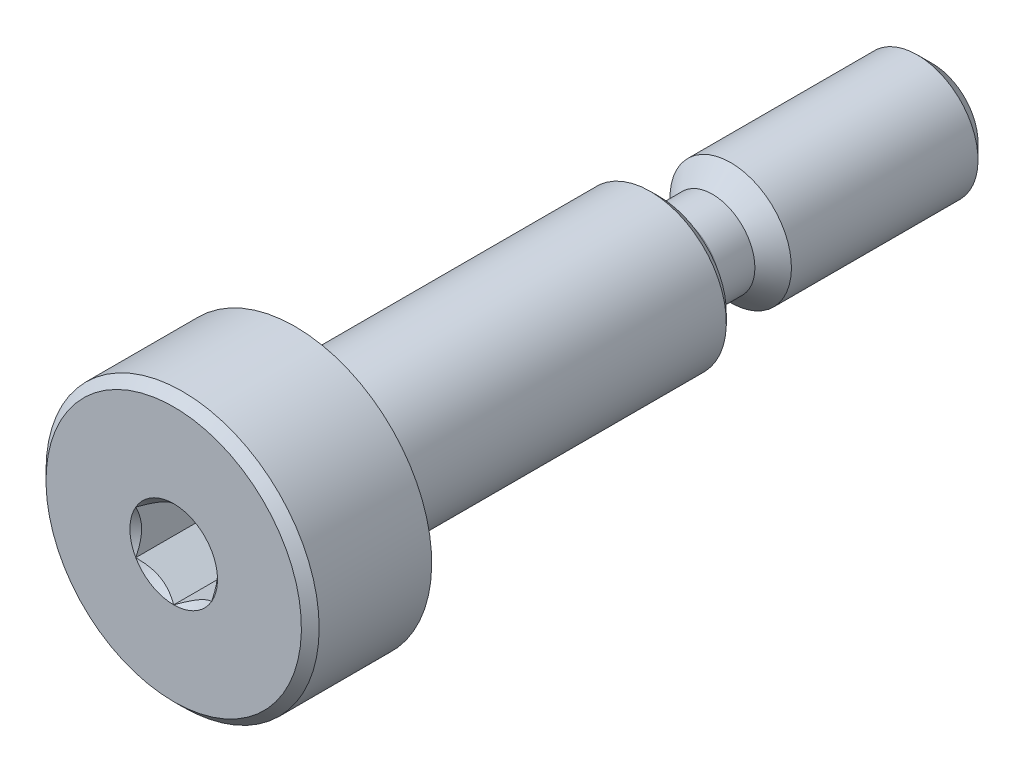
ISO-10303-21;
HEADER;
FILE_DESCRIPTION(('STEP AP214'),'2;1');
FILE_NAME('part.step','',(''),(''),'','','');
FILE_SCHEMA(('AUTOMOTIVE_DESIGN { 1 0 10303 214 1 1 1 1 }'));
ENDSEC;
DATA;
#1=APPLICATION_CONTEXT('core data for automotive mechanical design processes');
#2=APPLICATION_PROTOCOL_DEFINITION('international standard','automotive_design',2000,#1);
#3=PRODUCT_CONTEXT('',#1,'mechanical');
#4=PRODUCT('Part','Part','',(#3));
#5=PRODUCT_RELATED_PRODUCT_CATEGORY('part','',(#4));
#6=PRODUCT_DEFINITION_FORMATION('','',#4);
#7=PRODUCT_DEFINITION_CONTEXT('part definition',#1,'design');
#8=PRODUCT_DEFINITION('design','',#6,#7);
#9=PRODUCT_DEFINITION_SHAPE('','',#8);
#10=(LENGTH_UNIT() NAMED_UNIT(*) SI_UNIT(.MILLI.,.METRE.));
#11=(NAMED_UNIT(*) PLANE_ANGLE_UNIT() SI_UNIT($,.RADIAN.));
#12=(NAMED_UNIT(*) SI_UNIT($,.STERADIAN.) SOLID_ANGLE_UNIT());
#13=UNCERTAINTY_MEASURE_WITH_UNIT(LENGTH_MEASURE(1.E-05),#10,'distance_accuracy_value','');
#14=(GEOMETRIC_REPRESENTATION_CONTEXT(3) GLOBAL_UNCERTAINTY_ASSIGNED_CONTEXT((#13)) GLOBAL_UNIT_ASSIGNED_CONTEXT((#10,
#11,#12)) REPRESENTATION_CONTEXT('',''));
#15=CARTESIAN_POINT('',(0.,0.,0.));
#16=DIRECTION('',(0.,0.,1.));
#17=DIRECTION('',(1.,0.,0.));
#18=AXIS2_PLACEMENT_3D('',#15,#16,#17);
#19=CARTESIAN_POINT('',(0.,0.,-3.20750000000001));
#20=DIRECTION('',(0.,0.,1.));
#21=DIRECTION('',(1.,0.,0.));
#22=AXIS2_PLACEMENT_3D('',#19,#20,#21);
#23=PLANE('',#22);
#24=CARTESIAN_POINT('',(0.,0.,-3.20750000000001));
#25=DIRECTION('',(0.,0.,-1.));
#26=DIRECTION('',(0.,1.,0.));
#27=AXIS2_PLACEMENT_3D('',#24,#25,#26);
#28=CIRCLE('',#27,2.49999999999999);
#29=CARTESIAN_POINT('',(0.,2.49999999999999,-3.20750000000001));
#30=VERTEX_POINT('',#29);
#31=EDGE_CURVE('E53',#30,#30,#28,.F.);
#32=ORIENTED_EDGE('',*,*,#31,.T.);
#33=EDGE_LOOP('',(#32));
#34=FACE_BOUND('',#33,.T.);
#35=ADVANCED_FACE('F50',(#34),#23,.T.);
#36=CARTESIAN_POINT('',(0.,-2.,-12.5));
#37=DIRECTION('',(0.,0.,-1.));
#38=DIRECTION('',(0.,1.,0.));
#39=AXIS2_PLACEMENT_3D('',#36,#37,#38);
#40=PLANE('',#39);
#41=CARTESIAN_POINT('',(0.,0.,-12.5));
#42=DIRECTION('',(0.,0.,-1.));
#43=DIRECTION('',(0.,1.,0.));
#44=AXIS2_PLACEMENT_3D('',#41,#42,#43);
#45=CIRCLE('',#44,1.5);
#46=CARTESIAN_POINT('',(0.,1.49999999999999,-12.5));
#47=VERTEX_POINT('',#46);
#48=EDGE_CURVE('E69',#47,#47,#45,.T.);
#49=ORIENTED_EDGE('',*,*,#48,.T.);
#50=EDGE_LOOP('',(#49));
#51=FACE_BOUND('',#50,.T.);
#52=ADVANCED_FACE('F95',(#51),#40,.T.);
#53=CARTESIAN_POINT('',(0.,0.,-12.5));
#54=DIRECTION('',(0.,0.,1.));
#55=DIRECTION('',(0.,-1.,0.));
#56=AXIS2_PLACEMENT_3D('',#53,#54,#55);
#57=CONICAL_SURFACE('',#56,1.5,0.785398163397446);
#58=CARTESIAN_POINT('',(0.,0.,-12.));
#59=DIRECTION('',(0.,0.,-1.));
#60=DIRECTION('',(0.,1.,0.));
#61=AXIS2_PLACEMENT_3D('',#58,#59,#60);
#62=CIRCLE('',#61,2.);
#63=CARTESIAN_POINT('',(0.,1.99999999999999,-12.));
#64=VERTEX_POINT('',#63);
#65=EDGE_CURVE('E72',#64,#64,#62,.F.);
#66=ORIENTED_EDGE('',*,*,#65,.F.);
#67=EDGE_LOOP('',(#66));
#68=FACE_BOUND('',#67,.T.);
#69=ORIENTED_EDGE('',*,*,#48,.F.);
#70=EDGE_LOOP('',(#69));
#71=FACE_BOUND('',#70,.T.);
#72=ADVANCED_FACE('F97',(#68,#71),#57,.T.);
#73=CARTESIAN_POINT('',(0.,0.,-12.5));
#74=DIRECTION('',(0.,0.,-1.));
#75=DIRECTION('',(0.,1.,0.));
#76=AXIS2_PLACEMENT_3D('',#73,#74,#75);
#77=CYLINDRICAL_SURFACE('',#76,2.);
#78=ORIENTED_EDGE('',*,*,#65,.T.);
#79=EDGE_LOOP('',(#78));
#80=FACE_BOUND('',#79,.T.);
#81=CARTESIAN_POINT('',(0.,0.,-5.85200000000003));
#82=DIRECTION('',(0.,0.,-1.));
#83=DIRECTION('',(0.,1.,0.));
#84=AXIS2_PLACEMENT_3D('',#81,#82,#83);
#85=CIRCLE('',#84,2.);
#86=CARTESIAN_POINT('',(0.,1.99999999999999,-5.85200000000003));
#87=VERTEX_POINT('',#86);
#88=EDGE_CURVE('E66',#87,#87,#85,.F.);
#89=ORIENTED_EDGE('',*,*,#88,.F.);
#90=EDGE_LOOP('',(#89));
#91=FACE_BOUND('',#90,.T.);
#92=ADVANCED_FACE('F103',(#80,#91),#77,.T.);
#93=CARTESIAN_POINT('',(0.,0.,-5.25));
#94=DIRECTION('',(0.,0.,-1.));
#95=DIRECTION('',(0.,1.,0.));
#96=AXIS2_PLACEMENT_3D('',#93,#94,#95);
#97=CONICAL_SURFACE('',#96,1.39799999999999,0.78539816339744);
#98=ORIENTED_EDGE('',*,*,#88,.T.);
#99=EDGE_LOOP('',(#98));
#100=FACE_BOUND('',#99,.T.);
#101=CARTESIAN_POINT('',(0.,0.,-5.25));
#102=DIRECTION('',(0.,0.,-1.));
#103=DIRECTION('',(0.,1.,0.));
#104=AXIS2_PLACEMENT_3D('',#101,#102,#103);
#105=CIRCLE('',#104,1.39799999999999);
#106=CARTESIAN_POINT('',(0.,1.39799999999998,-5.25));
#107=VERTEX_POINT('',#106);
#108=EDGE_CURVE('E12',#107,#107,#105,.T.);
#109=ORIENTED_EDGE('',*,*,#108,.T.);
#110=EDGE_LOOP('',(#109));
#111=FACE_BOUND('',#110,.T.);
#112=ADVANCED_FACE('F112',(#100,#111),#97,.T.);
#113=CARTESIAN_POINT('',(0.,0.,-12.5));
#114=DIRECTION('',(0.,0.,-1.));
#115=DIRECTION('',(0.,1.,0.));
#116=AXIS2_PLACEMENT_3D('',#113,#114,#115);
#117=CYLINDRICAL_SURFACE('',#116,1.39799999999999);
#118=ORIENTED_EDGE('',*,*,#108,.F.);
#119=EDGE_LOOP('',(#118));
#120=FACE_BOUND('',#119,.T.);
#121=CARTESIAN_POINT('',(0.,0.,-4.10200000000002));
#122=DIRECTION('',(0.,0.,-1.));
#123=DIRECTION('',(0.,1.,0.));
#124=AXIS2_PLACEMENT_3D('',#121,#122,#123);
#125=CIRCLE('',#124,1.39799999999999);
#126=CARTESIAN_POINT('',(0.,1.39799999999998,-4.10200000000002));
#127=VERTEX_POINT('',#126);
#128=EDGE_CURVE('E57',#127,#127,#125,.T.);
#129=ORIENTED_EDGE('',*,*,#128,.T.);
#130=EDGE_LOOP('',(#129));
#131=FACE_BOUND('',#130,.T.);
#132=ADVANCED_FACE('F109',(#120,#131),#117,.T.);
#133=CARTESIAN_POINT('',(0.,0.,-4.10200000000002));
#134=DIRECTION('',(0.,0.,-1.));
#135=DIRECTION('',(0.,1.,0.));
#136=AXIS2_PLACEMENT_3D('',#133,#134,#135);
#137=TOROIDAL_SURFACE('',#136,2.,0.602000000000011);
#138=ORIENTED_EDGE('',*,*,#128,.F.);
#139=EDGE_LOOP('',(#138));
#140=FACE_BOUND('',#139,.T.);
#141=CARTESIAN_POINT('',(0.,0.,-3.5));
#142=DIRECTION('',(0.,0.,-1.));
#143=DIRECTION('',(0.,1.,0.));
#144=AXIS2_PLACEMENT_3D('',#141,#142,#143);
#145=CIRCLE('',#144,2.);
#146=CARTESIAN_POINT('',(0.,1.99999999999999,-3.5));
#147=VERTEX_POINT('',#146);
#148=EDGE_CURVE('E61',#147,#147,#145,.T.);
#149=ORIENTED_EDGE('',*,*,#148,.T.);
#150=EDGE_LOOP('',(#149));
#151=FACE_BOUND('',#150,.T.);
#152=ADVANCED_FACE('F91',(#140,#151),#137,.F.);
#153=CARTESIAN_POINT('',(0.,-2.5,-3.5));
#154=DIRECTION('',(0.,0.,-1.));
#155=DIRECTION('',(0.,1.,0.));
#156=AXIS2_PLACEMENT_3D('',#153,#154,#155);
#157=PLANE('',#156);
#158=CARTESIAN_POINT('',(0.,0.,-3.5));
#159=DIRECTION('',(0.,0.,-1.));
#160=DIRECTION('',(0.,1.,0.));
#161=AXIS2_PLACEMENT_3D('',#158,#159,#160);
#162=CIRCLE('',#161,2.20749999999999);
#163=CARTESIAN_POINT('',(0.,2.20749999999999,-3.5));
#164=VERTEX_POINT('',#163);
#165=EDGE_CURVE('E75',#164,#164,#162,.T.);
#166=ORIENTED_EDGE('',*,*,#165,.T.);
#167=EDGE_LOOP('',(#166));
#168=FACE_BOUND('',#167,.T.);
#169=ORIENTED_EDGE('',*,*,#148,.F.);
#170=EDGE_LOOP('',(#169));
#171=FACE_BOUND('',#170,.T.);
#172=ADVANCED_FACE('F86',(#168,#171),#157,.T.);
#173=CARTESIAN_POINT('',(0.,0.,-3.5));
#174=DIRECTION('',(0.,0.,1.));
#175=DIRECTION('',(0.,-1.,0.));
#176=AXIS2_PLACEMENT_3D('',#173,#174,#175);
#177=CONICAL_SURFACE('',#176,2.20749999999999,0.78539816339745);
#178=ORIENTED_EDGE('',*,*,#31,.F.);
#179=EDGE_LOOP('',(#178));
#180=FACE_BOUND('',#179,.T.);
#181=ORIENTED_EDGE('',*,*,#165,.F.);
#182=EDGE_LOOP('',(#181));
#183=FACE_BOUND('',#182,.T.);
#184=ADVANCED_FACE('F83',(#180,#183),#177,.T.);
#185=CLOSED_SHELL('',(#35,#52,#72,#92,#112,#132,#152,#172,#184));
#186=MANIFOLD_SOLID_BREP('B2',#185);
#187=CARTESIAN_POINT('',(0.,0.,7.7375));
#188=DIRECTION('',(0.,0.,1.));
#189=DIRECTION('',(1.,0.,0.));
#190=AXIS2_PLACEMENT_3D('',#187,#188,#189);
#191=PLANE('',#190);
#192=CARTESIAN_POINT('',(0.,0.,7.7375));
#193=DIRECTION('',(0.,0.,-1.));
#194=DIRECTION('',(0.,1.,0.));
#195=AXIS2_PLACEMENT_3D('',#192,#193,#194);
#196=CIRCLE('',#195,2.49999999999999);
#197=CARTESIAN_POINT('',(0.,2.49999999999999,7.7375));
#198=VERTEX_POINT('',#197);
#199=EDGE_CURVE('E193',#198,#198,#196,.T.);
#200=ORIENTED_EDGE('',*,*,#199,.T.);
#201=EDGE_LOOP('',(#200));
#202=FACE_BOUND('',#201,.T.);
#203=ADVANCED_FACE('F190',(#202),#191,.F.);
#204=CARTESIAN_POINT('',(0.,0.,-12.5));
#205=DIRECTION('',(0.,0.,-1.));
#206=DIRECTION('',(0.,1.,0.));
#207=AXIS2_PLACEMENT_3D('',#204,#205,#206);
#208=CYLINDRICAL_SURFACE('',#207,1.89999999999999);
#209=CARTESIAN_POINT('',(0.,0.,8.06250000000001));
#210=DIRECTION('',(0.,0.,-1.));
#211=DIRECTION('',(0.,1.,0.));
#212=AXIS2_PLACEMENT_3D('',#209,#210,#211);
#213=CIRCLE('',#212,1.89999999999999);
#214=CARTESIAN_POINT('',(0.,1.89999999999999,8.06250000000001));
#215=VERTEX_POINT('',#214);
#216=EDGE_CURVE('E457',#215,#215,#213,.F.);
#217=ORIENTED_EDGE('',*,*,#216,.T.);
#218=EDGE_LOOP('',(#217));
#219=FACE_BOUND('',#218,.T.);
#220=CARTESIAN_POINT('',(0.,0.,8.5));
#221=DIRECTION('',(0.,0.,-1.));
#222=DIRECTION('',(0.,1.,0.));
#223=AXIS2_PLACEMENT_3D('',#220,#221,#222);
#224=CIRCLE('',#223,1.89999999999999);
#225=CARTESIAN_POINT('',(0.,1.89999999999999,8.5));
#226=VERTEX_POINT('',#225);
#227=EDGE_CURVE('E268',#226,#226,#224,.T.);
#228=ORIENTED_EDGE('',*,*,#227,.T.);
#229=EDGE_LOOP('',(#228));
#230=FACE_BOUND('',#229,.T.);
#231=ADVANCED_FACE('F349',(#219,#230),#208,.T.);
#232=CARTESIAN_POINT('',(0.,2.49999999999999,7.9));
#233=DIRECTION('',(0.,0.,-1.));
#234=DIRECTION('',(0.,1.,0.));
#235=AXIS2_PLACEMENT_3D('',#232,#233,#234);
#236=PLANE('',#235);
#237=CARTESIAN_POINT('',(0.,0.,7.9));
#238=DIRECTION('',(0.,0.,-1.));
#239=DIRECTION('',(0.,1.,0.));
#240=AXIS2_PLACEMENT_3D('',#237,#238,#239);
#241=CIRCLE('',#240,2.33749999999999);
#242=CARTESIAN_POINT('',(0.,2.33749999999998,7.9));
#243=VERTEX_POINT('',#242);
#244=EDGE_CURVE('E452',#243,#243,#241,.F.);
#245=ORIENTED_EDGE('',*,*,#244,.T.);
#246=EDGE_LOOP('',(#245));
#247=FACE_BOUND('',#246,.T.);
#248=CARTESIAN_POINT('',(0.,0.,7.9));
#249=DIRECTION('',(0.,0.,-1.));
#250=DIRECTION('',(0.,1.,0.));
#251=AXIS2_PLACEMENT_3D('',#248,#249,#250);
#252=CIRCLE('',#251,2.0625);
#253=CARTESIAN_POINT('',(0.,2.06249999999999,7.9));
#254=VERTEX_POINT('',#253);
#255=EDGE_CURVE('E450',#254,#254,#252,.T.);
#256=ORIENTED_EDGE('',*,*,#255,.T.);
#257=EDGE_LOOP('',(#256));
#258=FACE_BOUND('',#257,.T.);
#259=ADVANCED_FACE('F354',(#247,#258),#236,.F.);
#260=CARTESIAN_POINT('',(0.,0.,12.5));
#261=DIRECTION('',(0.,0.,1.));
#262=DIRECTION('',(0.,-1.,0.));
#263=AXIS2_PLACEMENT_3D('',#260,#261,#262);
#264=PLANE('',#263);
#265=CARTESIAN_POINT('',(0.,0.,12.5));
#266=DIRECTION('',(0.,0.,1.));
#267=DIRECTION('',(1.,0.,0.));
#268=AXIS2_PLACEMENT_3D('',#265,#266,#267);
#269=CIRCLE('',#268,1.44337567297406);
#270=CARTESIAN_POINT('',(0.,-1.44337567297406,12.5));
#271=VERTEX_POINT('',#270);
#272=CARTESIAN_POINT('',(1.24999999999999,-0.721687836487041,12.5));
#273=VERTEX_POINT('',#272);
#274=EDGE_CURVE('E198',#271,#273,#269,.T.);
#275=ORIENTED_EDGE('',*,*,#274,.F.);
#276=CARTESIAN_POINT('',(-1.25,-0.721687836487035,12.5));
#277=VERTEX_POINT('',#276);
#278=EDGE_CURVE('E251',#277,#271,#269,.T.);
#279=ORIENTED_EDGE('',*,*,#278,.F.);
#280=CARTESIAN_POINT('',(-1.25,0.721687836487033,12.5));
#281=VERTEX_POINT('',#280);
#282=EDGE_CURVE('E280',#281,#277,#269,.T.);
#283=ORIENTED_EDGE('',*,*,#282,.F.);
#284=CARTESIAN_POINT('',(0.,1.44337567297406,12.5));
#285=VERTEX_POINT('',#284);
#286=EDGE_CURVE('E276',#285,#281,#269,.T.);
#287=ORIENTED_EDGE('',*,*,#286,.F.);
#288=CARTESIAN_POINT('',(1.25,0.721687836487034,12.5));
#289=VERTEX_POINT('',#288);
#290=EDGE_CURVE('E199',#289,#285,#269,.T.);
#291=ORIENTED_EDGE('',*,*,#290,.F.);
#292=EDGE_CURVE('E48',#273,#289,#269,.T.);
#293=ORIENTED_EDGE('',*,*,#292,.F.);
#294=EDGE_LOOP('',(#275,#279,#283,#287,#291,#293));
#295=FACE_BOUND('',#294,.T.);
#296=CARTESIAN_POINT('',(0.,0.,12.5));
#297=DIRECTION('',(0.,0.,1.));
#298=DIRECTION('',(0.,-1.,0.));
#299=AXIS2_PLACEMENT_3D('',#296,#297,#298);
#300=CIRCLE('',#299,4.20749999999999);
#301=CARTESIAN_POINT('',(0.,-4.2075,12.5));
#302=VERTEX_POINT('',#301);
#303=EDGE_CURVE('E462',#302,#302,#300,.T.);
#304=ORIENTED_EDGE('',*,*,#303,.T.);
#305=EDGE_LOOP('',(#304));
#306=FACE_BOUND('',#305,.T.);
#307=ADVANCED_FACE('F271',(#295,#306),#264,.T.);
#308=CARTESIAN_POINT('',(0.,0.,-12.5));
#309=DIRECTION('',(0.,0.,-1.));
#310=DIRECTION('',(0.,1.,0.));
#311=AXIS2_PLACEMENT_3D('',#308,#309,#310);
#312=CYLINDRICAL_SURFACE('',#311,4.49999999999999);
#313=CARTESIAN_POINT('',(0.,0.,12.2075));
#314=DIRECTION('',(0.,0.,1.));
#315=DIRECTION('',(0.,-1.,0.));
#316=AXIS2_PLACEMENT_3D('',#313,#314,#315);
#317=CIRCLE('',#316,4.49999999999999);
#318=CARTESIAN_POINT('',(0.,-4.5,12.2075));
#319=VERTEX_POINT('',#318);
#320=EDGE_CURVE('E460',#319,#319,#317,.F.);
#321=ORIENTED_EDGE('',*,*,#320,.T.);
#322=EDGE_LOOP('',(#321));
#323=FACE_BOUND('',#322,.T.);
#324=CARTESIAN_POINT('',(0.,0.,8.5));
#325=DIRECTION('',(0.,0.,-1.));
#326=DIRECTION('',(0.,1.,0.));
#327=AXIS2_PLACEMENT_3D('',#324,#325,#326);
#328=CIRCLE('',#327,4.49999999999999);
#329=CARTESIAN_POINT('',(0.,4.49999999999999,8.5));
#330=VERTEX_POINT('',#329);
#331=EDGE_CURVE('E446',#330,#330,#328,.T.);
#332=ORIENTED_EDGE('',*,*,#331,.F.);
#333=EDGE_LOOP('',(#332));
#334=FACE_BOUND('',#333,.T.);
#335=ADVANCED_FACE('F435',(#323,#334),#312,.T.);
#336=CARTESIAN_POINT('',(0.,-4.5,8.5));
#337=DIRECTION('',(0.,0.,-1.));
#338=DIRECTION('',(0.,1.,0.));
#339=AXIS2_PLACEMENT_3D('',#336,#337,#338);
#340=PLANE('',#339);
#341=ORIENTED_EDGE('',*,*,#331,.T.);
#342=EDGE_LOOP('',(#341));
#343=FACE_BOUND('',#342,.T.);
#344=ORIENTED_EDGE('',*,*,#227,.F.);
#345=EDGE_LOOP('',(#344));
#346=FACE_BOUND('',#345,.T.);
#347=ADVANCED_FACE('F431',(#343,#346),#340,.T.);
#348=CARTESIAN_POINT('',(0.,0.,7.7375));
#349=DIRECTION('',(0.,0.,-1.));
#350=DIRECTION('',(0.,1.,0.));
#351=AXIS2_PLACEMENT_3D('',#348,#349,#350);
#352=CONICAL_SURFACE('',#351,2.49999999999999,0.785398163397443);
#353=ORIENTED_EDGE('',*,*,#244,.F.);
#354=EDGE_LOOP('',(#353));
#355=FACE_BOUND('',#354,.T.);
#356=ORIENTED_EDGE('',*,*,#199,.F.);
#357=EDGE_LOOP('',(#356));
#358=FACE_BOUND('',#357,.T.);
#359=ADVANCED_FACE('F423',(#355,#358),#352,.T.);
#360=CARTESIAN_POINT('',(0.,0.,7.9));
#361=DIRECTION('',(0.,0.,-1.));
#362=DIRECTION('',(0.,1.,0.));
#363=AXIS2_PLACEMENT_3D('',#360,#361,#362);
#364=CONICAL_SURFACE('',#363,2.0625,0.785398163397452);
#365=ORIENTED_EDGE('',*,*,#216,.F.);
#366=EDGE_LOOP('',(#365));
#367=FACE_BOUND('',#366,.T.);
#368=ORIENTED_EDGE('',*,*,#255,.F.);
#369=EDGE_LOOP('',(#368));
#370=FACE_BOUND('',#369,.T.);
#371=ADVANCED_FACE('F417',(#367,#370),#364,.T.);
#372=CARTESIAN_POINT('',(0.,0.,12.2075));
#373=DIRECTION('',(0.,0.,-1.));
#374=DIRECTION('',(0.,1.,0.));
#375=AXIS2_PLACEMENT_3D('',#372,#373,#374);
#376=CONICAL_SURFACE('',#375,4.49999999999999,0.785398163397454);
#377=ORIENTED_EDGE('',*,*,#303,.F.);
#378=EDGE_LOOP('',(#377));
#379=FACE_BOUND('',#378,.T.);
#380=ORIENTED_EDGE('',*,*,#320,.F.);
#381=EDGE_LOOP('',(#380));
#382=FACE_BOUND('',#381,.T.);
#383=ADVANCED_FACE('F413',(#379,#382),#376,.T.);
#384=CARTESIAN_POINT('',(0.,0.,12.5));
#385=DIRECTION('',(0.,0.,1.));
#386=DIRECTION('',(1.,0.,0.));
#387=AXIS2_PLACEMENT_3D('',#384,#385,#386);
#388=CONICAL_SURFACE('',#387,1.44337567297406,0.78539816339745);
#389=ORIENTED_EDGE('',*,*,#290,.T.);
#390=CARTESIAN_POINT('',(1.2502,0.721572366433193,12.5001154839091));
#391=CARTESIAN_POINT('',(1.20722483292841,0.746384090710442,12.4753216680551));
#392=CARTESIAN_POINT('',(1.16353099525405,0.771610739653662,12.4519837344187));
#393=CARTESIAN_POINT('',(1.07443406915806,0.823050873919153,12.4092520040845));
#394=CARTESIAN_POINT('',(1.02902250164294,0.849269254648331,12.3898819923604));
#395=CARTESIAN_POINT('',(0.937452179064741,0.902137405038633,12.3567004834135));
#396=CARTESIAN_POINT('',(0.891316759824115,0.928773701756385,12.3428055590527));
#397=CARTESIAN_POINT('',(0.798029919592409,0.98263288407601,12.3213972821606));
#398=CARTESIAN_POINT('',(0.750881350863621,1.00985412292348,12.3138679415668));
#399=CARTESIAN_POINT('',(0.669626443112749,1.05676666578643,12.3070744980507));
#400=CARTESIAN_POINT('',(0.63562512337206,1.07639733689151,12.3060685591044));
#401=CARTESIAN_POINT('',(0.567682235567524,1.11562418145498,12.3077614149113));
#402=CARTESIAN_POINT('',(0.533740682344344,1.1352203463451,12.3104610272155));
#403=CARTESIAN_POINT('',(0.466185143542502,1.17422355485759,12.3194089303164));
#404=CARTESIAN_POINT('',(0.432571492713226,1.19363040521232,12.3256605258997));
#405=CARTESIAN_POINT('',(0.365905361782188,1.23212011385119,12.3413756814139));
#406=CARTESIAN_POINT('',(0.332853128969706,1.25120282936279,12.3508406200875));
#407=CARTESIAN_POINT('',(0.248200308399737,1.30007715810653,12.3789313906876));
#408=CARTESIAN_POINT('',(0.197133507570363,1.32956058931202,12.3996701574522));
#409=CARTESIAN_POINT('',(0.0969991458867466,1.38737318998519,12.4463871346715));
#410=CARTESIAN_POINT('',(0.047925688421732,1.41570576386268,12.4723482959468));
#411=CARTESIAN_POINT('',(-0.000199999999998997,1.4434911430279,12.5001154839091));
#412=B_SPLINE_CURVE_WITH_KNOTS('',3,(#390,#391,#392,#393,#394,#395,#396,#397,#398,#399,#400,
#401,#402,#403,#404,#405,#406,#407,#408,#409,#410,#411),.UNSPECIFIED.,.F.,.F.,(4,2,2,2,2,2,2,2,
2,2,4),(0.,0.166533409618303,0.334037607289761,0.498880396489697,0.663307919240273,
0.780963963458826,0.898645970148451,1.01643764860773,1.13427993171549,1.32148652032141,
1.50809158792573),.UNSPECIFIED.);
#413=EDGE_CURVE('E308',#289,#285,#412,.T.);
#414=ORIENTED_EDGE('',*,*,#413,.F.);
#415=EDGE_LOOP('',(#389,#414));
#416=FACE_BOUND('',#415,.T.);
#417=ADVANCED_FACE('F303',(#416),#388,.F.);
#418=ORIENTED_EDGE('',*,*,#286,.T.);
#419=CARTESIAN_POINT('',(0.000200000000000473,1.4434911430279,12.5001154839091));
#420=CARTESIAN_POINT('',(-0.0427751670715865,1.41867941875065,12.4753216680551));
#421=CARTESIAN_POINT('',(-0.0864690047459475,1.39345276980743,12.4519837344187));
#422=CARTESIAN_POINT('',(-0.175565930841941,1.34201263554194,12.4092520040845));
#423=CARTESIAN_POINT('',(-0.220977498357063,1.31579425481276,12.3898819923604));
#424=CARTESIAN_POINT('',(-0.312547820935259,1.26292610442246,12.3567004834135));
#425=CARTESIAN_POINT('',(-0.358683240175885,1.23628980770471,12.3428055590527));
#426=CARTESIAN_POINT('',(-0.451970080407592,1.18243062538508,12.3213972821606));
#427=CARTESIAN_POINT('',(-0.499118649136379,1.15520938653761,12.3138679415668));
#428=CARTESIAN_POINT('',(-0.580373556887251,1.10829684367467,12.3070744980507));
#429=CARTESIAN_POINT('',(-0.61437487662794,1.08866617256958,12.3060685591043));
#430=CARTESIAN_POINT('',(-0.682317764432477,1.04943932800611,12.3077614149113));
#431=CARTESIAN_POINT('',(-0.716259317655657,1.02984316311599,12.3104610272155));
#432=CARTESIAN_POINT('',(-0.783814856457499,0.990839954603497,12.3194089303164));
#433=CARTESIAN_POINT('',(-0.817428507286774,0.971433104248769,12.3256605258997));
#434=CARTESIAN_POINT('',(-0.884094638217812,0.932943395609904,12.3413756814139));
#435=CARTESIAN_POINT('',(-0.917146871030295,0.913860680098299,12.3508406200875));
#436=CARTESIAN_POINT('',(-1.00179969160026,0.864986351354566,12.3789313906876));
#437=CARTESIAN_POINT('',(-1.05286649242964,0.835502920149074,12.3996701574522));
#438=CARTESIAN_POINT('',(-1.15300085411325,0.777690319475907,12.4463871346715));
#439=CARTESIAN_POINT('',(-1.20207431157827,0.749357745598415,12.4723482959468));
#440=CARTESIAN_POINT('',(-1.2502,0.721572366433193,12.5001154839091));
#441=B_SPLINE_CURVE_WITH_KNOTS('',3,(#419,#420,#421,#422,#423,#424,#425,#426,#427,#428,#429,
#430,#431,#432,#433,#434,#435,#436,#437,#438,#439,#440),.UNSPECIFIED.,.F.,.F.,(4,2,2,2,2,2,2,2,
2,2,4),(0.,0.166533409618303,0.334037607289761,0.498880396489697,0.663307919240274,
0.780963963458826,0.898645970148452,1.01643764860773,1.13427993171549,1.32148652032141,
1.50809158792574),.UNSPECIFIED.);
#442=EDGE_CURVE('E279',#285,#281,#441,.T.);
#443=ORIENTED_EDGE('',*,*,#442,.F.);
#444=EDGE_LOOP('',(#418,#443));
#445=FACE_BOUND('',#444,.T.);
#446=ADVANCED_FACE('F406',(#445),#388,.F.);
#447=ORIENTED_EDGE('',*,*,#282,.T.);
#448=CARTESIAN_POINT('',(-1.25,-1.43934010808077,12.9629820968923));
#449=CARTESIAN_POINT('',(-1.25,-1.40429313005659,12.9365249226329));
#450=CARTESIAN_POINT('',(-1.25,-1.36905087135599,12.9103271603543));
#451=CARTESIAN_POINT('',(-1.25,-1.29809650706311,12.8585575718396));
#452=CARTESIAN_POINT('',(-1.25,-1.26238428576495,12.8329859043563));
#453=CARTESIAN_POINT('',(-1.25,-1.15390111792708,12.7570059936895));
#454=CARTESIAN_POINT('',(-1.25,-1.08031646726264,12.7077402861896));
#455=CARTESIAN_POINT('',(-1.25,-0.926012322755096,12.6110258302631));
#456=CARTESIAN_POINT('',(-1.25,-0.845125318656148,12.5638412989418));
#457=CARTESIAN_POINT('',(-1.25,-0.679311174076604,12.4775307343904));
#458=CARTESIAN_POINT('',(-1.25,-0.594398891026689,12.4383775346269));
#459=CARTESIAN_POINT('',(-1.25,-0.466944812460742,12.3904772236883));
#460=CARTESIAN_POINT('',(-1.25,-0.426289985812823,12.3767294897863));
#461=CARTESIAN_POINT('',(-1.25,-0.343998850091269,12.3524979274505));
#462=CARTESIAN_POINT('',(-1.25,-0.302362473614964,12.3420143238698));
#463=CARTESIAN_POINT('',(-1.25,-0.219052696285667,12.3250301617483));
#464=CARTESIAN_POINT('',(-1.25,-0.177393428474501,12.3184613604714));
#465=CARTESIAN_POINT('',(-1.25,-0.0936293693401936,12.3094350534578));
#466=CARTESIAN_POINT('',(-1.25,-0.0515246558543974,12.3069768409973));
#467=CARTESIAN_POINT('',(-1.25,0.0311890576306303,12.3063540620133));
#468=CARTESIAN_POINT('',(-1.25,0.0717969625499291,12.3080371168462));
#469=CARTESIAN_POINT('',(-1.25,0.152668636885196,12.3152682705979));
#470=CARTESIAN_POINT('',(-1.25,0.192932338835357,12.3208171104131));
#471=CARTESIAN_POINT('',(-1.25,0.273499879165294,12.335571036465));
#472=CARTESIAN_POINT('',(-1.25,0.31379218061851,12.3448381759641));
#473=CARTESIAN_POINT('',(-1.25,0.393496413911456,12.3665361784573));
#474=CARTESIAN_POINT('',(-1.25,0.432908419115058,12.3789667767306));
#475=CARTESIAN_POINT('',(-1.25,0.556992735862297,12.4227793529314));
#476=CARTESIAN_POINT('',(-1.25,0.639898924666083,12.459151072876));
#477=CARTESIAN_POINT('',(-1.25,0.801816555499699,12.5400191621783));
#478=CARTESIAN_POINT('',(-1.25,0.880812666325042,12.584544720912));
#479=CARTESIAN_POINT('',(-1.25,1.0317856127975,12.6764048766666));
#480=CARTESIAN_POINT('',(-1.25,1.10391618485086,12.7234899339162));
#481=CARTESIAN_POINT('',(-1.25,1.2101860604331,12.7962785615985));
#482=CARTESIAN_POINT('',(-1.25,1.24515069969379,12.8207980853934));
#483=CARTESIAN_POINT('',(-1.25,1.31460220852736,12.8704856367657));
#484=CARTESIAN_POINT('',(-1.25,1.34908920596618,12.8956534854155));
#485=CARTESIAN_POINT('',(-1.25,1.38337731682911,12.9210901488412));
#486=B_SPLINE_CURVE_WITH_KNOTS('',3,(#448,#449,#450,#451,#452,#453,#454,#455,#456,#457,#458,
#459,#460,#461,#462,#463,#464,#465,#466,#467,#468,#469,#470,#471,#472,#473,#474,#475,#476,#477,
#478,#479,#480,#481,#482,#483,#484,#485),.UNSPECIFIED.,.F.,.F.,(4,2,2,2,2,2,2,2,2,2,2,2,2,2,2,2,
2,2,4),(0.,0.131732960381448,0.263498984161645,0.529042014455826,0.80974192613462,
1.08947609717225,1.21811634272577,1.346765447839,1.47310084517844,1.59941451973785,
1.72115042167849,1.84290966131735,1.96679153905342,2.09066305366039,2.36146692896009,
2.63325989198491,2.89154668212279,3.01965734507713,3.14773302245628),.UNSPECIFIED.);
#487=EDGE_CURVE('E282',#281,#277,#486,.F.);
#488=ORIENTED_EDGE('',*,*,#487,.F.);
#489=EDGE_LOOP('',(#447,#488));
#490=FACE_BOUND('',#489,.T.);
#491=ADVANCED_FACE('F403',(#490),#388,.F.);
#492=ORIENTED_EDGE('',*,*,#278,.T.);
#493=CARTESIAN_POINT('',(-1.2502,-0.721572366433197,12.5001154839091));
#494=CARTESIAN_POINT('',(-1.20722483292841,-0.746384090710447,12.4753216680551));
#495=CARTESIAN_POINT('',(-1.16353099525405,-0.771610739653667,12.4519837344187));
#496=CARTESIAN_POINT('',(-1.07443406915806,-0.823050873919157,12.4092520040845));
#497=CARTESIAN_POINT('',(-1.02902250164294,-0.849269254648335,12.3898819923604));
#498=CARTESIAN_POINT('',(-0.937452179064742,-0.902137405038637,12.3567004834135));
#499=CARTESIAN_POINT('',(-0.891316759824116,-0.928773701756389,12.3428055590527));
#500=CARTESIAN_POINT('',(-0.79802991959241,-0.982632884076014,12.3213972821606));
#501=CARTESIAN_POINT('',(-0.750881350863623,-1.00985412292349,12.3138679415668));
#502=CARTESIAN_POINT('',(-0.66962644311275,-1.05676666578643,12.3070744980507));
#503=CARTESIAN_POINT('',(-0.635625123372062,-1.07639733689152,12.3060685591044));
#504=CARTESIAN_POINT('',(-0.567682235567525,-1.11562418145499,12.3077614149113));
#505=CARTESIAN_POINT('',(-0.533740682344345,-1.13522034634511,12.3104610272155));
#506=CARTESIAN_POINT('',(-0.466185143542503,-1.1742235548576,12.3194089303164));
#507=CARTESIAN_POINT('',(-0.432571492713228,-1.19363040521233,12.3256605258997));
#508=CARTESIAN_POINT('',(-0.36590536178219,-1.23212011385119,12.3413756814139));
#509=CARTESIAN_POINT('',(-0.332853128969707,-1.2512028293628,12.3508406200875));
#510=CARTESIAN_POINT('',(-0.248200308399738,-1.30007715810653,12.3789313906876));
#511=CARTESIAN_POINT('',(-0.197133507570363,-1.32956058931202,12.3996701574522));
#512=CARTESIAN_POINT('',(-0.0969991458867464,-1.38737318998519,12.4463871346715));
#513=CARTESIAN_POINT('',(-0.0479256884217317,-1.41570576386268,12.4723482959468));
#514=CARTESIAN_POINT('',(0.000199999999999056,-1.44349114302791,12.5001154839091));
#515=B_SPLINE_CURVE_WITH_KNOTS('',3,(#493,#494,#495,#496,#497,#498,#499,#500,#501,#502,#503,
#504,#505,#506,#507,#508,#509,#510,#511,#512,#513,#514),.UNSPECIFIED.,.F.,.F.,(4,2,2,2,2,2,2,2,
2,2,4),(0.,0.166533409618302,0.334037607289759,0.498880396489694,0.66330791924027,
0.780963963458822,0.898645970148448,1.01643764860773,1.13427993171549,1.32148652032141,
1.50809158792573),.UNSPECIFIED.);
#516=EDGE_CURVE('E263',#277,#271,#515,.T.);
#517=ORIENTED_EDGE('',*,*,#516,.F.);
#518=EDGE_LOOP('',(#492,#517));
#519=FACE_BOUND('',#518,.T.);
#520=ADVANCED_FACE('F412',(#519),#388,.F.);
#521=ORIENTED_EDGE('',*,*,#274,.T.);
#522=CARTESIAN_POINT('',(-0.000200000000000874,-1.44349114302791,12.5001154839091));
#523=CARTESIAN_POINT('',(0.0427751670715859,-1.41867941875066,12.4753216680551));
#524=CARTESIAN_POINT('',(0.0864690047459474,-1.39345276980744,12.4519837344187));
#525=CARTESIAN_POINT('',(0.175565930841942,-1.34201263554195,12.4092520040845));
#526=CARTESIAN_POINT('',(0.220977498357064,-1.31579425481277,12.3898819923604));
#527=CARTESIAN_POINT('',(0.31254782093526,-1.26292610442246,12.3567004834135));
#528=CARTESIAN_POINT('',(0.358683240175886,-1.23628980770471,12.3428055590527));
#529=CARTESIAN_POINT('',(0.451970080407592,-1.18243062538509,12.3213972821606));
#530=CARTESIAN_POINT('',(0.49911864913638,-1.15520938653762,12.3138679415668));
#531=CARTESIAN_POINT('',(0.580373556887252,-1.10829684367467,12.3070744980507));
#532=CARTESIAN_POINT('',(0.614374876627941,-1.08866617256958,12.3060685591044));
#533=CARTESIAN_POINT('',(0.682317764432477,-1.04943932800611,12.3077614149113));
#534=CARTESIAN_POINT('',(0.716259317655657,-1.029843163116,12.3104610272155));
#535=CARTESIAN_POINT('',(0.7838148564575,-0.990839954603503,12.3194089303164));
#536=CARTESIAN_POINT('',(0.817428507286775,-0.971433104248774,12.3256605258997));
#537=CARTESIAN_POINT('',(0.884094638217814,-0.932943395609909,12.3413756814139));
#538=CARTESIAN_POINT('',(0.917146871030296,-0.913860680098304,12.3508406200875));
#539=CARTESIAN_POINT('',(1.00179969160026,-0.864986351354572,12.3789313906876));
#540=CARTESIAN_POINT('',(1.05286649242964,-0.83550292014908,12.3996701574522));
#541=CARTESIAN_POINT('',(1.15300085411325,-0.777690319475912,12.4463871346715));
#542=CARTESIAN_POINT('',(1.20207431157827,-0.74935774559842,12.4723482959468));
#543=CARTESIAN_POINT('',(1.2502,-0.721572366433198,12.5001154839091));
#544=B_SPLINE_CURVE_WITH_KNOTS('',3,(#522,#523,#524,#525,#526,#527,#528,#529,#530,#531,#532,
#533,#534,#535,#536,#537,#538,#539,#540,#541,#542,#543),.UNSPECIFIED.,.F.,.F.,(4,2,2,2,2,2,2,2,
2,2,4),(0.,0.166533409618304,0.334037607289762,0.498880396489699,0.663307919240275,
0.780963963458827,0.898645970148454,1.01643764860773,1.1342799317155,1.32148652032141,
1.50809158792574),.UNSPECIFIED.);
#545=EDGE_CURVE('E247',#271,#273,#544,.T.);
#546=ORIENTED_EDGE('',*,*,#545,.F.);
#547=EDGE_LOOP('',(#521,#546));
#548=FACE_BOUND('',#547,.T.);
#549=ADVANCED_FACE('F245',(#548),#388,.F.);
#550=ORIENTED_EDGE('',*,*,#292,.T.);
#551=CARTESIAN_POINT('',(1.25,-1.43934010829019,12.9629820970504));
#552=CARTESIAN_POINT('',(1.25,-1.40429313026013,12.9365249227849));
#553=CARTESIAN_POINT('',(1.25,-1.36905087155364,12.9103271605002));
#554=CARTESIAN_POINT('',(1.25,-1.29809650724891,12.8585575719734));
#555=CARTESIAN_POINT('',(1.25,-1.2623842859448,12.8329859044841));
#556=CARTESIAN_POINT('',(1.25,-1.1539011180887,12.757005993799));
#557=CARTESIAN_POINT('',(1.25,-1.08031646741188,12.707740286287));
#558=CARTESIAN_POINT('',(1.25,-0.926012322877303,12.6110258303356));
#559=CARTESIAN_POINT('',(1.25,-0.84512531876365,12.5638412990016));
#560=CARTESIAN_POINT('',(1.25,-0.679311174153445,12.4775307344266));
#561=CARTESIAN_POINT('',(1.25,-0.594398891087586,12.4383775346522));
#562=CARTESIAN_POINT('',(1.25,-0.466944812509641,12.3904772237056));
#563=CARTESIAN_POINT('',(1.25,-0.426289985866746,12.3767294898039));
#564=CARTESIAN_POINT('',(1.25,-0.343998850155404,12.3524979274677));
#565=CARTESIAN_POINT('',(1.25,-0.302362473684287,12.3420143238863));
#566=CARTESIAN_POINT('',(1.25,-0.219052696365196,12.3250301617622));
#567=CARTESIAN_POINT('',(1.25,-0.177393428559045,12.3184613604834));
#568=CARTESIAN_POINT('',(1.25,-0.0936293694345985,12.309435053465));
#569=CARTESIAN_POINT('',(1.25,-0.0515246559536492,12.3069768410015));
#570=CARTESIAN_POINT('',(1.25,0.0311890575224386,12.3063540620107));
#571=CARTESIAN_POINT('',(1.25,0.0717969624376319,12.3080371168399));
#572=CARTESIAN_POINT('',(1.25,0.152668636765093,12.3152682705835));
#573=CARTESIAN_POINT('',(1.25,0.192932338711554,12.3208171103943));
#574=CARTESIAN_POINT('',(1.25,0.273499879034189,12.335571036437));
#575=CARTESIAN_POINT('',(1.25,0.313792180483814,12.3448381759314));
#576=CARTESIAN_POINT('',(1.25,0.393496413769926,12.3665361784149));
#577=CARTESIAN_POINT('',(1.25,0.432908418970283,12.3789667766833));
#578=CARTESIAN_POINT('',(1.25,0.556992735685997,12.4227793528609));
#579=CARTESIAN_POINT('',(1.25,0.639898924463083,12.4591510727842));
#580=CARTESIAN_POINT('',(1.25,0.801816555245347,12.5400191620416));
#581=CARTESIAN_POINT('',(1.25,0.880812666046052,12.5845447207516));
#582=CARTESIAN_POINT('',(1.25,1.03178561247421,12.676404876461));
#583=CARTESIAN_POINT('',(1.25,1.10391618450775,12.7234899336892));
#584=CARTESIAN_POINT('',(1.25,1.2101860600607,12.7962785613395));
#585=CARTESIAN_POINT('',(1.25,1.24515069931176,12.8207980851238));
#586=CARTESIAN_POINT('',(1.25,1.31460220812614,12.8704856364749));
#587=CARTESIAN_POINT('',(1.25,1.3490892055554,12.8956534851142));
#588=CARTESIAN_POINT('',(1.25,1.38337731640879,12.9210901485293));
#589=B_SPLINE_CURVE_WITH_KNOTS('',3,(#551,#552,#553,#554,#555,#556,#557,#558,#559,#560,#561,
#562,#563,#564,#565,#566,#567,#568,#569,#570,#571,#572,#573,#574,#575,#576,#577,#578,#579,#580,
#581,#582,#583,#584,#585,#586,#587,#588),.UNSPECIFIED.,.F.,.F.,(4,2,2,2,2,2,2,2,2,2,2,2,2,2,2,2,
2,2,4),(0.,0.131732960406522,0.263498984211802,0.529042014557082,0.809741926293179,
1.08947609738757,1.21811634292656,1.34676544802529,1.47310084535082,1.59941451989631,
1.72115042182424,1.84290966145034,1.96679153917269,2.09066305376595,2.36146692896708,
2.63325989189267,2.89154668194565,3.01965734485811,3.1477330221954),.UNSPECIFIED.);
#590=EDGE_CURVE('E252',#273,#289,#589,.T.);
#591=ORIENTED_EDGE('',*,*,#590,.F.);
#592=EDGE_LOOP('',(#550,#591));
#593=FACE_BOUND('',#592,.T.);
#594=ADVANCED_FACE('F253',(#593),#388,.F.);
#595=CARTESIAN_POINT('',(0.,0.,10.5));
#596=DIRECTION('',(0.,0.,1.));
#597=DIRECTION('',(1.,0.,0.));
#598=AXIS2_PLACEMENT_3D('',#595,#596,#597);
#599=PLANE('',#598);
#600=DIRECTION('',(0.,1.,0.));
#601=VECTOR('',#600,1.);
#602=CARTESIAN_POINT('',(1.25,-0.721687836487036,10.5));
#603=LINE('',#602,#601);
#604=CARTESIAN_POINT('',(1.25,-0.721687836487036,10.5));
#605=VERTEX_POINT('',#604);
#606=CARTESIAN_POINT('',(1.25,0.721687836487031,10.5));
#607=VERTEX_POINT('',#606);
#608=EDGE_CURVE('E255',#605,#607,#603,.T.);
#609=ORIENTED_EDGE('',*,*,#608,.T.);
#610=DIRECTION('',(-0.866025403784439,0.5,0.));
#611=VECTOR('',#610,1.);
#612=CARTESIAN_POINT('',(1.25,0.721687836487031,10.5));
#613=LINE('',#612,#611);
#614=CARTESIAN_POINT('',(0.,1.44337567297406,10.5));
#615=VERTEX_POINT('',#614);
#616=EDGE_CURVE('E372',#607,#615,#613,.T.);
#617=ORIENTED_EDGE('',*,*,#616,.T.);
#618=DIRECTION('',(-0.866025403784439,-0.5,0.));
#619=VECTOR('',#618,1.);
#620=CARTESIAN_POINT('',(0.,1.44337567297406,10.5));
#621=LINE('',#620,#619);
#622=CARTESIAN_POINT('',(-1.25,0.721687836487031,10.5));
#623=VERTEX_POINT('',#622);
#624=EDGE_CURVE('E392',#615,#623,#621,.T.);
#625=ORIENTED_EDGE('',*,*,#624,.T.);
#626=DIRECTION('',(0.,-1.,0.));
#627=VECTOR('',#626,1.);
#628=CARTESIAN_POINT('',(-1.25,0.721687836487031,10.5));
#629=LINE('',#628,#627);
#630=CARTESIAN_POINT('',(-1.25,-0.721687836487035,10.5));
#631=VERTEX_POINT('',#630);
#632=EDGE_CURVE('E389',#623,#631,#629,.T.);
#633=ORIENTED_EDGE('',*,*,#632,.T.);
#634=DIRECTION('',(0.866025403784438,-0.500000000000001,0.));
#635=VECTOR('',#634,1.);
#636=CARTESIAN_POINT('',(-1.25,-0.721687836487035,10.5));
#637=LINE('',#636,#635);
#638=CARTESIAN_POINT('',(0.,-1.44337567297407,10.5));
#639=VERTEX_POINT('',#638);
#640=EDGE_CURVE('E376',#631,#639,#637,.T.);
#641=ORIENTED_EDGE('',*,*,#640,.T.);
#642=DIRECTION('',(0.866025403784439,0.5,0.));
#643=VECTOR('',#642,1.);
#644=CARTESIAN_POINT('',(0.,-1.44337567297407,10.5));
#645=LINE('',#644,#643);
#646=EDGE_CURVE('E373',#639,#605,#645,.T.);
#647=ORIENTED_EDGE('',*,*,#646,.T.);
#648=EDGE_LOOP('',(#609,#617,#625,#633,#641,#647));
#649=FACE_BOUND('',#648,.T.);
#650=ADVANCED_FACE('F302',(#649),#599,.T.);
#651=CARTESIAN_POINT('',(1.25,0.721687836487031,10.5));
#652=DIRECTION('',(0.5,0.866025403784439,0.));
#653=DIRECTION('',(-0.866025403784439,0.5,0.));
#654=AXIS2_PLACEMENT_3D('',#651,#652,#653);
#655=PLANE('',#654);
#656=DIRECTION('',(0.,0.,1.));
#657=VECTOR('',#656,1.);
#658=CARTESIAN_POINT('',(1.25,0.721687836487031,10.5));
#659=LINE('',#658,#657);
#660=EDGE_CURVE('E211',#607,#289,#659,.T.);
#661=ORIENTED_EDGE('',*,*,#660,.T.);
#662=ORIENTED_EDGE('',*,*,#413,.T.);
#663=DIRECTION('',(0.,0.,1.));
#664=VECTOR('',#663,1.);
#665=CARTESIAN_POINT('',(0.,1.44337567297406,10.5));
#666=LINE('',#665,#664);
#667=EDGE_CURVE('E374',#615,#285,#666,.T.);
#668=ORIENTED_EDGE('',*,*,#667,.F.);
#669=ORIENTED_EDGE('',*,*,#616,.F.);
#670=EDGE_LOOP('',(#661,#662,#668,#669));
#671=FACE_BOUND('',#670,.T.);
#672=ADVANCED_FACE('F345',(#671),#655,.F.);
#673=CARTESIAN_POINT('',(0.,1.44337567297406,10.5));
#674=DIRECTION('',(-0.5,0.866025403784439,0.));
#675=DIRECTION('',(-0.866025403784439,-0.5,0.));
#676=AXIS2_PLACEMENT_3D('',#673,#674,#675);
#677=PLANE('',#676);
#678=ORIENTED_EDGE('',*,*,#667,.T.);
#679=ORIENTED_EDGE('',*,*,#442,.T.);
#680=DIRECTION('',(0.,0.,1.));
#681=VECTOR('',#680,1.);
#682=CARTESIAN_POINT('',(-1.25,0.721687836487031,10.5));
#683=LINE('',#682,#681);
#684=EDGE_CURVE('E378',#623,#281,#683,.T.);
#685=ORIENTED_EDGE('',*,*,#684,.F.);
#686=ORIENTED_EDGE('',*,*,#624,.F.);
#687=EDGE_LOOP('',(#678,#679,#685,#686));
#688=FACE_BOUND('',#687,.T.);
#689=ADVANCED_FACE('F296',(#688),#677,.F.);
#690=CARTESIAN_POINT('',(-1.25,0.721687836487031,10.5));
#691=DIRECTION('',(-1.,0.,0.));
#692=DIRECTION('',(0.,0.,1.));
#693=AXIS2_PLACEMENT_3D('',#690,#691,#692);
#694=PLANE('',#693);
#695=ORIENTED_EDGE('',*,*,#684,.T.);
#696=ORIENTED_EDGE('',*,*,#487,.T.);
#697=DIRECTION('',(0.,0.,1.));
#698=VECTOR('',#697,1.);
#699=CARTESIAN_POINT('',(-1.25,-0.721687836487035,10.5));
#700=LINE('',#699,#698);
#701=EDGE_CURVE('E384',#631,#277,#700,.T.);
#702=ORIENTED_EDGE('',*,*,#701,.F.);
#703=ORIENTED_EDGE('',*,*,#632,.F.);
#704=EDGE_LOOP('',(#695,#696,#702,#703));
#705=FACE_BOUND('',#704,.T.);
#706=ADVANCED_FACE('F337',(#705),#694,.F.);
#707=CARTESIAN_POINT('',(-1.25,-0.721687836487035,10.5));
#708=DIRECTION('',(-0.500000000000001,-0.866025403784438,0.));
#709=DIRECTION('',(0.866025403784438,-0.500000000000001,0.));
#710=AXIS2_PLACEMENT_3D('',#707,#708,#709);
#711=PLANE('',#710);
#712=ORIENTED_EDGE('',*,*,#701,.T.);
#713=ORIENTED_EDGE('',*,*,#516,.T.);
#714=DIRECTION('',(0.,0.,1.));
#715=VECTOR('',#714,1.);
#716=CARTESIAN_POINT('',(0.,-1.44337567297407,10.5));
#717=LINE('',#716,#715);
#718=EDGE_CURVE('E262',#639,#271,#717,.T.);
#719=ORIENTED_EDGE('',*,*,#718,.F.);
#720=ORIENTED_EDGE('',*,*,#640,.F.);
#721=EDGE_LOOP('',(#712,#713,#719,#720));
#722=FACE_BOUND('',#721,.T.);
#723=ADVANCED_FACE('F334',(#722),#711,.F.);
#724=CARTESIAN_POINT('',(0.,-1.44337567297407,10.5));
#725=DIRECTION('',(0.5,-0.866025403784439,0.));
#726=DIRECTION('',(0.866025403784439,0.5,0.));
#727=AXIS2_PLACEMENT_3D('',#724,#725,#726);
#728=PLANE('',#727);
#729=ORIENTED_EDGE('',*,*,#718,.T.);
#730=ORIENTED_EDGE('',*,*,#545,.T.);
#731=DIRECTION('',(0.,0.,1.));
#732=VECTOR('',#731,1.);
#733=CARTESIAN_POINT('',(1.25,-0.721687836487036,10.5));
#734=LINE('',#733,#732);
#735=EDGE_CURVE('E261',#605,#273,#734,.T.);
#736=ORIENTED_EDGE('',*,*,#735,.F.);
#737=ORIENTED_EDGE('',*,*,#646,.F.);
#738=EDGE_LOOP('',(#729,#730,#736,#737));
#739=FACE_BOUND('',#738,.T.);
#740=ADVANCED_FACE('F259',(#739),#728,.F.);
#741=CARTESIAN_POINT('',(1.25,-0.721687836487036,10.5));
#742=DIRECTION('',(1.,0.,0.));
#743=DIRECTION('',(0.,1.,0.));
#744=AXIS2_PLACEMENT_3D('',#741,#742,#743);
#745=PLANE('',#744);
#746=ORIENTED_EDGE('',*,*,#735,.T.);
#747=ORIENTED_EDGE('',*,*,#590,.T.);
#748=ORIENTED_EDGE('',*,*,#660,.F.);
#749=ORIENTED_EDGE('',*,*,#608,.F.);
#750=EDGE_LOOP('',(#746,#747,#748,#749));
#751=FACE_BOUND('',#750,.T.);
#752=ADVANCED_FACE('F265',(#751),#745,.F.);
#753=CLOSED_SHELL('',(#203,#231,#259,#307,#335,#347,#359,#371,#383,#417,#446,#491,#520,#549,
#594,#650,#672,#689,#706,#723,#740,#752));
#754=MANIFOLD_SOLID_BREP('B7',#753);
#755=CARTESIAN_POINT('',(0.,0.,-3.20750000000001));
#756=DIRECTION('',(0.,0.,1.));
#757=DIRECTION('',(1.,0.,0.));
#758=AXIS2_PLACEMENT_3D('',#755,#756,#757);
#759=PLANE('',#758);
#760=CARTESIAN_POINT('',(0.,0.,-3.20750000000001));
#761=DIRECTION('',(0.,0.,-1.));
#762=DIRECTION('',(0.,1.,0.));
#763=AXIS2_PLACEMENT_3D('',#760,#761,#762);
#764=CIRCLE('',#763,2.49999999999999);
#765=CARTESIAN_POINT('',(0.,2.49999999999999,-3.20750000000001));
#766=VERTEX_POINT('',#765);
#767=EDGE_CURVE('E189',#766,#766,#764,.F.);
#768=ORIENTED_EDGE('',*,*,#767,.F.);
#769=EDGE_LOOP('',(#768));
#770=FACE_BOUND('',#769,.T.);
#771=ADVANCED_FACE('F601',(#770),#759,.F.);
#772=CARTESIAN_POINT('',(0.,0.,7.7375));
#773=DIRECTION('',(0.,0.,1.));
#774=DIRECTION('',(1.,0.,0.));
#775=AXIS2_PLACEMENT_3D('',#772,#773,#774);
#776=PLANE('',#775);
#777=CARTESIAN_POINT('',(0.,0.,7.7375));
#778=DIRECTION('',(0.,0.,-1.));
#779=DIRECTION('',(0.,1.,0.));
#780=AXIS2_PLACEMENT_3D('',#777,#778,#779);
#781=CIRCLE('',#780,2.49999999999999);
#782=CARTESIAN_POINT('',(0.,2.49999999999999,7.7375));
#783=VERTEX_POINT('',#782);
#784=EDGE_CURVE('E607',#783,#783,#781,.T.);
#785=ORIENTED_EDGE('',*,*,#784,.F.);
#786=EDGE_LOOP('',(#785));
#787=FACE_BOUND('',#786,.T.);
#788=ADVANCED_FACE('F615',(#787),#776,.T.);
#789=CARTESIAN_POINT('',(0.,0.,-12.5));
#790=DIRECTION('',(0.,0.,-1.));
#791=DIRECTION('',(0.,1.,0.));
#792=AXIS2_PLACEMENT_3D('',#789,#790,#791);
#793=CYLINDRICAL_SURFACE('',#792,2.49999999999999);
#794=ORIENTED_EDGE('',*,*,#767,.T.);
#795=EDGE_LOOP('',(#794));
#796=FACE_BOUND('',#795,.T.);
#797=ORIENTED_EDGE('',*,*,#784,.T.);
#798=EDGE_LOOP('',(#797));
#799=FACE_BOUND('',#798,.T.);
#800=ADVANCED_FACE('F613',(#796,#799),#793,.T.);
#801=CLOSED_SHELL('',(#771,#788,#800));
#802=MANIFOLD_SOLID_BREP('B42',#801);
#803=ADVANCED_BREP_SHAPE_REPRESENTATION('',(#18,#186,#754,#802),#14);
#804=SHAPE_DEFINITION_REPRESENTATION(#9,#803);
ENDSEC;
END-ISO-10303-21;
